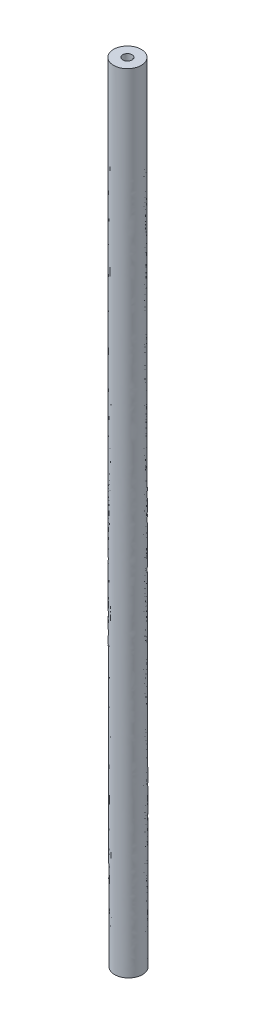
ISO-10303-21;
HEADER;
FILE_DESCRIPTION(('STEP AP214'),'2;1');
FILE_NAME('part.step','',(''),(''),'','','');
FILE_SCHEMA(('AUTOMOTIVE_DESIGN { 1 0 10303 214 1 1 1 1 }'));
ENDSEC;
DATA;
#1=APPLICATION_CONTEXT('core data for automotive mechanical design processes');
#2=APPLICATION_PROTOCOL_DEFINITION('international standard','automotive_design',2000,#1);
#3=PRODUCT_CONTEXT('',#1,'mechanical');
#4=PRODUCT('Part','Part','',(#3));
#5=PRODUCT_RELATED_PRODUCT_CATEGORY('part','',(#4));
#6=PRODUCT_DEFINITION_FORMATION('','',#4);
#7=PRODUCT_DEFINITION_CONTEXT('part definition',#1,'design');
#8=PRODUCT_DEFINITION('design','',#6,#7);
#9=PRODUCT_DEFINITION_SHAPE('','',#8);
#10=(LENGTH_UNIT() NAMED_UNIT(*) SI_UNIT(.MILLI.,.METRE.));
#11=(NAMED_UNIT(*) PLANE_ANGLE_UNIT() SI_UNIT($,.RADIAN.));
#12=(NAMED_UNIT(*) SI_UNIT($,.STERADIAN.) SOLID_ANGLE_UNIT());
#13=UNCERTAINTY_MEASURE_WITH_UNIT(LENGTH_MEASURE(1.E-05),#10,'distance_accuracy_value','');
#14=(GEOMETRIC_REPRESENTATION_CONTEXT(3) GLOBAL_UNCERTAINTY_ASSIGNED_CONTEXT((#13)) GLOBAL_UNIT_ASSIGNED_CONTEXT((#10,
#11,#12)) REPRESENTATION_CONTEXT('',''));
#15=CARTESIAN_POINT('',(0.,0.,0.));
#16=DIRECTION('',(0.,0.,1.));
#17=DIRECTION('',(1.,0.,0.));
#18=AXIS2_PLACEMENT_3D('',#15,#16,#17);
#19=CARTESIAN_POINT('',(0.124999951172267,-85.,1.5));
#20=CARTESIAN_POINT('',(0.104166609701249,-76.666666666647,1.5));
#21=CARTESIAN_POINT('',(0.0833331703333813,-68.3333333049463,1.5));
#22=CARTESIAN_POINT('',(0.0208335264151385,-43.3333681122283,1.5));
#23=CARTESIAN_POINT('',(2.0724184714006E-07,-26.6666840078161,1.5));
#24=CARTESIAN_POINT('',(-4.14483262527916E-08,-6.66666667064939,1.5));
#25=CARTESIAN_POINT('',(0.,-3.33333333333468,1.5));
#26=CARTESIAN_POINT('',(0.,0.,1.5));
#27=CARTESIAN_POINT('',(3.12499057620889,-84.9925000205078,1.5));
#28=CARTESIAN_POINT('',(3.10415723473787,-76.6591666871548,1.5));
#29=CARTESIAN_POINT('',(3.08332223289065,-68.3252083272368,1.5));
#30=CARTESIAN_POINT('',(3.02082727640395,-43.3271181265666,1.5));
#31=CARTESIAN_POINT('',(3.00000020721294,-26.6654340099378,1.5));
#32=CARTESIAN_POINT('',(2.99999995855746,-6.66691666996462,1.5));
#33=CARTESIAN_POINT('',(3.,-3.33333333333468,1.5));
#34=CARTESIAN_POINT('',(3.,0.,1.5));
#35=CARTESIAN_POINT('',(3.12499057620889,-84.9925000205078,-1.5));
#36=CARTESIAN_POINT('',(3.10415723473787,-76.6591666871548,-1.5));
#37=CARTESIAN_POINT('',(3.08332223289065,-68.3252083272368,-1.5));
#38=CARTESIAN_POINT('',(3.02082727640395,-43.3271181265666,-1.5));
#39=CARTESIAN_POINT('',(3.00000020721294,-26.6654340099378,-1.5));
#40=CARTESIAN_POINT('',(2.99999995855746,-6.66691666996462,-1.5));
#41=CARTESIAN_POINT('',(3.,-3.33333333333468,-1.5));
#42=CARTESIAN_POINT('',(3.,0.,-1.5));
#43=CARTESIAN_POINT('',(0.124999951172267,-85.,-1.5));
#44=CARTESIAN_POINT('',(0.104166609701249,-76.666666666647,-1.5));
#45=CARTESIAN_POINT('',(0.0833331703333815,-68.3333333049463,-1.5));
#46=CARTESIAN_POINT('',(0.0208335264151387,-43.3333681122283,-1.5));
#47=CARTESIAN_POINT('',(2.07241847323757E-07,-26.6666840078161,-1.5));
#48=CARTESIAN_POINT('',(-4.14483260690946E-08,-6.66666667064939,-1.5));
#49=CARTESIAN_POINT('',(0.,-3.33333333333468,-1.5));
#50=CARTESIAN_POINT('',(0.,0.,-1.5));
#51=CARTESIAN_POINT('',(-2.87499067386435,-85.0074999794922,-1.5));
#52=CARTESIAN_POINT('',(-2.89582401533537,-76.6741666461392,-1.5));
#53=CARTESIAN_POINT('',(-2.91665589222389,-68.3414582826559,-1.5));
#54=CARTESIAN_POINT('',(-2.97916022357368,-43.3396180978899,-1.5));
#55=CARTESIAN_POINT('',(-2.99999979272924,-26.6679340056943,-1.5));
#56=CARTESIAN_POINT('',(-3.00000004145411,-6.66641667133416,-1.5));
#57=CARTESIAN_POINT('',(-3.,-3.33333333333468,-1.5));
#58=CARTESIAN_POINT('',(-3.,0.,-1.5));
#59=CARTESIAN_POINT('',(-2.87499067386435,-85.0074999794922,1.5));
#60=CARTESIAN_POINT('',(-2.89582401533537,-76.6741666461392,1.5));
#61=CARTESIAN_POINT('',(-2.91665589222389,-68.3414582826559,1.5));
#62=CARTESIAN_POINT('',(-2.97916022357368,-43.3396180978899,1.5));
#63=CARTESIAN_POINT('',(-2.99999979272924,-26.6679340056943,1.5));
#64=CARTESIAN_POINT('',(-3.00000004145411,-6.66641667133416,1.5));
#65=CARTESIAN_POINT('',(-3.,-3.33333333333468,1.5));
#66=CARTESIAN_POINT('',(-3.,0.,1.5));
#67=CARTESIAN_POINT('',(0.124999951172267,-85.,1.5));
#68=CARTESIAN_POINT('',(0.104166609701249,-76.666666666647,1.5));
#69=CARTESIAN_POINT('',(0.0833331703333813,-68.3333333049463,1.5));
#70=CARTESIAN_POINT('',(0.0208335264151385,-43.3333681122283,1.5));
#71=CARTESIAN_POINT('',(2.0724184714006E-07,-26.6666840078161,1.5));
#72=CARTESIAN_POINT('',(-4.14483262527916E-08,-6.66666667064939,1.5));
#73=CARTESIAN_POINT('',(0.,-3.33333333333468,1.5));
#74=CARTESIAN_POINT('',(0.,0.,1.5));
#75=(BOUNDED_SURFACE() B_SPLINE_SURFACE(3,3,((#19,#20,#21,#22,#23,#24,#25,#26),(#27,#28,#29,#30,
#31,#32,#33,#34),(#35,#36,#37,#38,#39,#40,#41,#42),(#43,#44,#45,#46,#47,#48,#49,#50),(#51,#52,
#53,#54,#55,#56,#57,#58),(#59,#60,#61,#62,#63,#64,#65,#66),(#67,#68,#69,#70,#71,#72,#73,#74)),
.UNSPECIFIED.,.T.,.F.,.F.) B_SPLINE_SURFACE_WITH_KNOTS((4,3,4),(4,2,2,4),(0.,0.5,1.),(0.,
0.294118115627878,0.882353121395057,1.),
.UNSPECIFIED.) GEOMETRIC_REPRESENTATION_ITEM() RATIONAL_B_SPLINE_SURFACE(((1.,1.,1.,1.,1.,1.,1.,
1.),(0.333333333333333,0.333333333333333,0.333333333333333,0.333333333333333,0.333333333333333,
0.333333333333333,0.333333333333333,0.333333333333333),(0.333333333333333,0.333333333333333,
0.333333333333333,0.333333333333333,0.333333333333333,0.333333333333333,0.333333333333333,
0.333333333333333),(1.,1.,1.,1.,1.,1.,1.,1.),(0.333333333333333,0.333333333333333,
0.333333333333333,0.333333333333333,0.333333333333333,0.333333333333333,0.333333333333333,
0.333333333333333),(0.333333333333333,0.333333333333333,0.333333333333333,0.333333333333333,
0.333333333333333,0.333333333333333,0.333333333333333,0.333333333333333),(1.,1.,1.,1.,1.,1.,1.,1.))) REPRESENTATION_ITEM('') SURFACE());
#76=CARTESIAN_POINT('',(0.,0.,0.));
#77=DIRECTION('',(0.,1.,0.));
#78=DIRECTION('',(0.,0.,1.));
#79=AXIS2_PLACEMENT_3D('',#76,#77,#78);
#80=CIRCLE('',#79,1.5);
#81=CARTESIAN_POINT('',(0.,0.,1.5));
#82=VERTEX_POINT('',#81);
#83=EDGE_CURVE('E59',#82,#82,#80,.T.);
#84=CARTESIAN_POINT('',(0.124999951172267,-85.,0.));
#85=DIRECTION('',(-0.00249999316405852,0.999996875012207,0.));
#86=DIRECTION('',(0.,0.,1.));
#87=AXIS2_PLACEMENT_3D('',#84,#85,#86);
#88=CIRCLE('',#87,1.5);
#89=CARTESIAN_POINT('',(0.124999951172267,-85.,1.5));
#90=VERTEX_POINT('',#89);
#91=EDGE_CURVE('E48',#90,#90,#88,.T.);
#92=CARTESIAN_POINT('',(0.,0.,1.5));
#93=CARTESIAN_POINT('',(1.777831612656E-06,-0.885418023176545,1.5));
#94=CARTESIAN_POINT('',(8.85991342765471E-07,-1.77083604640011,1.5));
#95=CARTESIAN_POINT('',(-8.98877253564571E-07,-3.54167209296118,1.5));
#96=CARTESIAN_POINT('',(-1.79190558000423E-06,-4.42709011629868,1.5));
#97=CARTESIAN_POINT('',(1.75900542073227E-06,-6.19792616254585,1.5));
#98=CARTESIAN_POINT('',(6.20294474589656E-06,-7.08334418545553,1.5));
#99=CARTESIAN_POINT('',(-6.23502225809553E-06,-8.85418023088871,1.5));
#100=CARTESIAN_POINT('',(-2.31169285688901E-05,-9.73959825341221,1.5));
#101=CARTESIAN_POINT('',(4.26644909528556E-05,-11.5104342964598,1.5));
#102=CARTESIAN_POINT('',(0.000125327816723265,-12.3958523169839,1.5));
#103=CARTESIAN_POINT('',(0.00041308367913828,-14.1666883386019,1.5));
#104=CARTESIAN_POINT('',(0.000618176215846645,-15.0521063396957,1.5));
#105=CARTESIAN_POINT('',(0.00114465874478629,-16.8229423075236,1.5));
#106=CARTESIAN_POINT('',(0.00146604873706903,-17.7083602742577,1.5));
#107=CARTESIAN_POINT('',(0.00222676916431861,-19.4791961574761,1.5));
#108=CARTESIAN_POINT('',(0.0026660995993284,-20.3646140739605,1.5));
#109=CARTESIAN_POINT('',(0.0036622606634537,-22.1354498410469,1.5));
#110=CARTESIAN_POINT('',(0.00421909129260282,-23.020867691649,1.5));
#111=CARTESIAN_POINT('',(0.00545037069686834,-24.7917033112693,1.5));
#112=CARTESIAN_POINT('',(0.00612481947200918,-25.6771210802876,1.5));
#113=CARTESIAN_POINT('',(0.00759130355410078,-27.4479565210572,1.5));
#114=CARTESIAN_POINT('',(0.00838333886106675,-28.3333741928086,1.5));
#115=CARTESIAN_POINT('',(0.0100850044562869,-30.1042094233564,1.5));
#116=CARTESIAN_POINT('',(0.0109946347445471,-30.9896269821528,1.5));
#117=CARTESIAN_POINT('',(0.0129314880633102,-32.7604619711041,1.5));
#118=CARTESIAN_POINT('',(0.01395871109381,-33.6458794012589,1.5));
#119=CARTESIAN_POINT('',(0.016130750348466,-35.4167141172401,1.5));
#120=CARTESIAN_POINT('',(0.0172755665726097,-36.3021314030665,1.5));
#121=CARTESIAN_POINT('',(0.0196827925926552,-38.0729658147027,1.5));
#122=CARTESIAN_POINT('',(0.0209452023885352,-38.9583829405124,1.5));
#123=CARTESIAN_POINT('',(0.0235876135329439,-40.7292170164335,1.5));
#124=CARTESIAN_POINT('',(0.0249676148814416,-41.6146339665449,1.5));
#125=CARTESIAN_POINT('',(0.0278452167741321,-43.3854676753624,1.5));
#126=CARTESIAN_POINT('',(0.0293428173182849,-44.2708844340685,1.5));
#127=CARTESIAN_POINT('',(0.032455588993919,-46.0417177444628,1.5));
#128=CARTESIAN_POINT('',(0.0340707601253511,-46.927134296151,1.5));
#129=CARTESIAN_POINT('',(0.0374187797106737,-48.6979671765454,1.5));
#130=CARTESIAN_POINT('',(0.0391516281645057,-49.5833835052516,1.5));
#131=CARTESIAN_POINT('',(0.0427346040071858,-51.354215925029,1.5));
#132=CARTESIAN_POINT('',(0.0445847313959666,-52.2396320161002,1.5));
#133=CARTESIAN_POINT('',(0.0484037518678921,-54.010463941062,1.5));
#134=CARTESIAN_POINT('',(0.0503726449509594,-54.8958797749528,1.5));
#135=CARTESIAN_POINT('',(0.054423648106224,-56.6667111842665,1.5));
#136=CARTESIAN_POINT('',(0.0565057581783387,-57.5521267596895,1.5));
#137=CARTESIAN_POINT('',(0.0608039033192534,-59.3229575831675,1.5));
#138=CARTESIAN_POINT('',(0.0630199383880248,-60.2083728312225,1.5));
#139=CARTESIAN_POINT('',(0.0674488341988951,-61.9792033347433,1.5));
#140=CARTESIAN_POINT('',(0.0696616949409899,-62.8646185902091,1.5));
#141=CARTESIAN_POINT('',(0.0740882715161526,-64.6354491004521,1.5));
#142=CARTESIAN_POINT('',(0.0763019873492213,-65.5208643552293,1.5));
#143=CARTESIAN_POINT('',(0.0807291935338865,-67.2916948660234,1.5));
#144=CARTESIAN_POINT('',(0.0829426838854827,-68.1771101220402,1.5));
#145=CARTESIAN_POINT('',(0.0873697277522617,-69.947940634538,1.5));
#146=CARTESIAN_POINT('',(0.0895832812674445,-70.833355891019,1.5));
#147=CARTESIAN_POINT('',(0.0940103732263803,-72.6041864043941,1.5));
#148=CARTESIAN_POINT('',(0.0962239116701333,-73.4896016612881,1.5));
#149=CARTESIAN_POINT('',(0.100650993553988,-75.2604321752442,1.5));
#150=CARTESIAN_POINT('',(0.10286453699409,-76.1458474323061,1.5));
#151=CARTESIAN_POINT('',(0.107291622607317,-77.9166779464048,1.5));
#152=CARTESIAN_POINT('',(0.109505164780441,-78.8020932034415,1.5));
#153=CARTESIAN_POINT('',(0.113932248618013,-80.5729237172826,1.5));
#154=CARTESIAN_POINT('',(0.11614579028246,-81.458338974087,1.5));
#155=CARTESIAN_POINT('',(0.120572872105573,-83.2291694872599,1.5));
#156=CARTESIAN_POINT('',(0.122786412264239,-84.1145847436284,1.5));
#157=CARTESIAN_POINT('',(0.124999951172267,-85.,1.5));
#158=B_SPLINE_CURVE_WITH_KNOTS('',3,(#92,#93,#94,#95,#96,#97,#98,#99,#100,#101,#102,#103,#104,
#105,#106,#107,#108,#109,#110,#111,#112,#113,#114,#115,#116,#117,#118,#119,#120,#121,#122,#123,
#124,#125,#126,#127,#128,#129,#130,#131,#132,#133,#134,#135,#136,#137,#138,#139,#140,#141,#142,
#143,#144,#145,#146,#147,#148,#149,#150,#151,#152,#153,#154,#155,#156,#157),.UNSPECIFIED.,.F.,
.F.,(4,2,2,2,2,2,2,2,2,2,2,2,2,2,2,2,2,2,2,2,2,2,2,2,2,2,2,2,2,2,2,2,4),(0.,2.65625406962368,
5.31250813958915,7.9687622085533,10.6250162752304,13.2812703402495,15.937524406652,
18.59377847423,21.2500325427755,23.9062866120806,26.5625406819376,29.2187947521384,
31.8750488224752,34.5313028927402,37.1875569627255,39.8438110322231,42.5000651010253,
45.1563191689243,47.8125732357122,50.4688273011813,53.1250813651237,55.7813354273319,
58.437589487598,61.093843547295,63.7500976104255,66.4063516765612,69.0626057450844,
71.7188598153773,74.3751138868223,77.0313679588016,79.6876220306973,82.3438761018919,
85.0001301717676),.UNSPECIFIED.);
#159=EDGE_CURVE('',#82,#90,#158,.T.);
#160=ORIENTED_EDGE('',*,*,#83,.F.);
#161=ORIENTED_EDGE('',*,*,#91,.T.);
#162=ORIENTED_EDGE('',*,*,#159,.T.);
#163=ORIENTED_EDGE('',*,*,#159,.F.);
#164=EDGE_LOOP('',(#160,#162,#161,#163));
#165=FACE_BOUND('',#164,.T.);
#166=ADVANCED_FACE('F43',(#165),#75,.T.);
#167=CARTESIAN_POINT('',(0.124999951172267,-85.,0.));
#168=DIRECTION('',(-0.00249999316405852,0.999996875012207,0.));
#169=DIRECTION('',(0.,0.,1.));
#170=AXIS2_PLACEMENT_3D('',#167,#168,#169);
#171=PLANE('',#170);
#172=CARTESIAN_POINT('',(0.124999951172267,-85.,0.));
#173=DIRECTION('',(-0.00249999316405852,0.999996875012207,0.));
#174=DIRECTION('',(0.,0.,1.));
#175=AXIS2_PLACEMENT_3D('',#172,#173,#174);
#176=CIRCLE('',#175,0.5);
#177=CARTESIAN_POINT('',(0.124999951172267,-85.,0.5));
#178=VERTEX_POINT('',#177);
#179=EDGE_CURVE('E53',#178,#178,#176,.F.);
#180=ORIENTED_EDGE('',*,*,#179,.F.);
#181=EDGE_LOOP('',(#180));
#182=FACE_BOUND('',#181,.T.);
#183=ORIENTED_EDGE('',*,*,#91,.F.);
#184=EDGE_LOOP('',(#183));
#185=FACE_BOUND('',#184,.T.);
#186=ADVANCED_FACE('F70',(#182,#185),#171,.F.);
#187=CARTESIAN_POINT('',(0.,0.,0.));
#188=DIRECTION('',(0.,1.,0.));
#189=DIRECTION('',(0.,0.,1.));
#190=AXIS2_PLACEMENT_3D('',#187,#188,#189);
#191=PLANE('',#190);
#192=CARTESIAN_POINT('',(0.,0.,0.));
#193=DIRECTION('',(0.,1.,0.));
#194=DIRECTION('',(0.,0.,1.));
#195=AXIS2_PLACEMENT_3D('',#192,#193,#194);
#196=CIRCLE('',#195,0.5);
#197=CARTESIAN_POINT('',(0.,0.,0.5));
#198=VERTEX_POINT('',#197);
#199=EDGE_CURVE('E10',#198,#198,#196,.F.);
#200=ORIENTED_EDGE('',*,*,#199,.T.);
#201=EDGE_LOOP('',(#200));
#202=FACE_BOUND('',#201,.T.);
#203=ORIENTED_EDGE('',*,*,#83,.T.);
#204=EDGE_LOOP('',(#203));
#205=FACE_BOUND('',#204,.T.);
#206=ADVANCED_FACE('F72',(#202,#205),#191,.T.);
#207=CARTESIAN_POINT('',(0.124999951172267,-85.,0.5));
#208=CARTESIAN_POINT('',(0.104166609701249,-76.666666666647,0.5));
#209=CARTESIAN_POINT('',(0.0833331703333813,-68.3333333049463,0.5));
#210=CARTESIAN_POINT('',(0.0208335264151385,-43.3333681122283,0.5));
#211=CARTESIAN_POINT('',(2.0724184714006E-07,-26.6666840078161,0.5));
#212=CARTESIAN_POINT('',(-4.14483262527916E-08,-6.66666667064939,0.5));
#213=CARTESIAN_POINT('',(0.,-3.33333333333468,0.5));
#214=CARTESIAN_POINT('',(0.,0.,0.5));
#215=CARTESIAN_POINT('',(-0.87499692383994,-85.0024999931641,0.5));
#216=CARTESIAN_POINT('',(-0.895830265310958,-76.6691666598111,0.5));
#217=CARTESIAN_POINT('',(-0.916663183852902,-68.3360416308688,0.5));
#218=CARTESIAN_POINT('',(-0.979164390246746,-43.3354514407436,0.5));
#219=CARTESIAN_POINT('',(-0.999999792749118,-26.6671006737803,0.5));
#220=CARTESIAN_POINT('',(-1.00000004145013,-6.66658333754335,0.5));
#221=CARTESIAN_POINT('',(-1.,-3.33333333333468,0.5));
#222=CARTESIAN_POINT('',(-1.,0.,0.5));
#223=CARTESIAN_POINT('',(-0.87499692383994,-85.0024999931641,-0.5));
#224=CARTESIAN_POINT('',(-0.895830265310958,-76.6691666598111,-0.5));
#225=CARTESIAN_POINT('',(-0.916663183852902,-68.3360416308688,-0.5));
#226=CARTESIAN_POINT('',(-0.979164390246746,-43.3354514407436,-0.5));
#227=CARTESIAN_POINT('',(-0.999999792749118,-26.6671006737803,-0.5));
#228=CARTESIAN_POINT('',(-1.00000004145013,-6.66658333754335,-0.5));
#229=CARTESIAN_POINT('',(-1.,-3.33333333333468,-0.5));
#230=CARTESIAN_POINT('',(-1.,0.,-0.5));
#231=CARTESIAN_POINT('',(0.124999951172267,-85.,-0.5));
#232=CARTESIAN_POINT('',(0.104166609701249,-76.666666666647,-0.5));
#233=CARTESIAN_POINT('',(0.0833331703333813,-68.3333333049463,-0.5));
#234=CARTESIAN_POINT('',(0.0208335264151386,-43.3333681122283,-0.5));
#235=CARTESIAN_POINT('',(2.07241847201293E-07,-26.6666840078161,-0.5));
#236=CARTESIAN_POINT('',(-4.14483261915593E-08,-6.66666667064939,-0.5));
#237=CARTESIAN_POINT('',(0.,-3.33333333333468,-0.5));
#238=CARTESIAN_POINT('',(0.,0.,-0.5));
#239=CARTESIAN_POINT('',(1.12499682618447,-84.9975000068359,-0.5));
#240=CARTESIAN_POINT('',(1.10416348471346,-76.664166673483,-0.5));
#241=CARTESIAN_POINT('',(1.08332952451966,-68.3306249790239,-0.5));
#242=CARTESIAN_POINT('',(1.02083144307702,-43.3312847837129,-0.5));
#243=CARTESIAN_POINT('',(1.00000020723281,-26.6662673418518,-0.5));
#244=CARTESIAN_POINT('',(0.999999958553481,-6.66675000375543,-0.5));
#245=CARTESIAN_POINT('',(1.,-3.33333333333468,-0.5));
#246=CARTESIAN_POINT('',(1.,0.,-0.5));
#247=CARTESIAN_POINT('',(1.12499682618447,-84.9975000068359,0.5));
#248=CARTESIAN_POINT('',(1.10416348471346,-76.664166673483,0.5));
#249=CARTESIAN_POINT('',(1.08332952451966,-68.3306249790239,0.5));
#250=CARTESIAN_POINT('',(1.02083144307702,-43.3312847837129,0.5));
#251=CARTESIAN_POINT('',(1.00000020723281,-26.6662673418518,0.5));
#252=CARTESIAN_POINT('',(0.999999958553481,-6.66675000375543,0.5));
#253=CARTESIAN_POINT('',(1.,-3.33333333333468,0.5));
#254=CARTESIAN_POINT('',(1.,0.,0.5));
#255=CARTESIAN_POINT('',(0.124999951172267,-85.,0.5));
#256=CARTESIAN_POINT('',(0.104166609701249,-76.666666666647,0.5));
#257=CARTESIAN_POINT('',(0.0833331703333813,-68.3333333049463,0.5));
#258=CARTESIAN_POINT('',(0.0208335264151385,-43.3333681122283,0.5));
#259=CARTESIAN_POINT('',(2.0724184714006E-07,-26.6666840078161,0.5));
#260=CARTESIAN_POINT('',(-4.14483262527916E-08,-6.66666667064939,0.5));
#261=CARTESIAN_POINT('',(0.,-3.33333333333468,0.5));
#262=CARTESIAN_POINT('',(0.,0.,0.5));
#263=(BOUNDED_SURFACE() B_SPLINE_SURFACE(3,3,((#207,#208,#209,#210,#211,#212,#213,#214),(#215,
#216,#217,#218,#219,#220,#221,#222),(#223,#224,#225,#226,#227,#228,#229,#230),(#231,#232,#233,
#234,#235,#236,#237,#238),(#239,#240,#241,#242,#243,#244,#245,#246),(#247,#248,#249,#250,#251,
#252,#253,#254),(#255,#256,#257,#258,#259,#260,#261,#262)),.UNSPECIFIED.,.T.,.F.,
.F.) B_SPLINE_SURFACE_WITH_KNOTS((4,3,4),(4,2,2,4),(0.,0.5,1.),(0.,0.294118115627878,
0.882353121395057,1.),
.UNSPECIFIED.) GEOMETRIC_REPRESENTATION_ITEM() RATIONAL_B_SPLINE_SURFACE(((1.,1.,1.,1.,1.,1.,1.,
1.),(0.333333333333333,0.333333333333333,0.333333333333333,0.333333333333333,0.333333333333333,
0.333333333333333,0.333333333333333,0.333333333333333),(0.333333333333333,0.333333333333333,
0.333333333333333,0.333333333333333,0.333333333333333,0.333333333333333,0.333333333333333,
0.333333333333333),(1.,1.,1.,1.,1.,1.,1.,1.),(0.333333333333333,0.333333333333333,
0.333333333333333,0.333333333333333,0.333333333333333,0.333333333333333,0.333333333333333,
0.333333333333333),(0.333333333333333,0.333333333333333,0.333333333333333,0.333333333333333,
0.333333333333333,0.333333333333333,0.333333333333333,0.333333333333333),(1.,1.,1.,1.,1.,1.,1.,1.))) REPRESENTATION_ITEM('') SURFACE());
#264=CARTESIAN_POINT('',(0.,0.,0.5));
#265=CARTESIAN_POINT('',(1.777831612656E-06,-0.885418023176545,0.5));
#266=CARTESIAN_POINT('',(8.85991342765471E-07,-1.77083604640011,0.5));
#267=CARTESIAN_POINT('',(-8.98877253564571E-07,-3.54167209296118,0.5));
#268=CARTESIAN_POINT('',(-1.79190558000423E-06,-4.42709011629868,0.5));
#269=CARTESIAN_POINT('',(1.75900542073227E-06,-6.19792616254585,0.5));
#270=CARTESIAN_POINT('',(6.20294474589656E-06,-7.08334418545553,0.5));
#271=CARTESIAN_POINT('',(-6.23502225809553E-06,-8.85418023088871,0.5));
#272=CARTESIAN_POINT('',(-2.31169285688901E-05,-9.73959825341221,0.5));
#273=CARTESIAN_POINT('',(4.26644909528556E-05,-11.5104342964598,0.5));
#274=CARTESIAN_POINT('',(0.000125327816723265,-12.3958523169839,0.5));
#275=CARTESIAN_POINT('',(0.00041308367913828,-14.1666883386019,0.5));
#276=CARTESIAN_POINT('',(0.000618176215846645,-15.0521063396957,0.5));
#277=CARTESIAN_POINT('',(0.00114465874478629,-16.8229423075236,0.5));
#278=CARTESIAN_POINT('',(0.00146604873706903,-17.7083602742577,0.5));
#279=CARTESIAN_POINT('',(0.00222676916431861,-19.4791961574761,0.5));
#280=CARTESIAN_POINT('',(0.0026660995993284,-20.3646140739605,0.5));
#281=CARTESIAN_POINT('',(0.0036622606634537,-22.1354498410469,0.5));
#282=CARTESIAN_POINT('',(0.00421909129260282,-23.020867691649,0.5));
#283=CARTESIAN_POINT('',(0.00545037069686834,-24.7917033112693,0.5));
#284=CARTESIAN_POINT('',(0.00612481947200918,-25.6771210802876,0.5));
#285=CARTESIAN_POINT('',(0.00759130355410078,-27.4479565210572,0.5));
#286=CARTESIAN_POINT('',(0.00838333886106675,-28.3333741928086,0.5));
#287=CARTESIAN_POINT('',(0.0100850044562869,-30.1042094233564,0.5));
#288=CARTESIAN_POINT('',(0.0109946347445471,-30.9896269821528,0.5));
#289=CARTESIAN_POINT('',(0.0129314880633102,-32.7604619711041,0.5));
#290=CARTESIAN_POINT('',(0.01395871109381,-33.6458794012589,0.5));
#291=CARTESIAN_POINT('',(0.016130750348466,-35.4167141172401,0.5));
#292=CARTESIAN_POINT('',(0.0172755665726097,-36.3021314030665,0.5));
#293=CARTESIAN_POINT('',(0.0196827925926552,-38.0729658147027,0.5));
#294=CARTESIAN_POINT('',(0.0209452023885352,-38.9583829405124,0.5));
#295=CARTESIAN_POINT('',(0.0235876135329439,-40.7292170164335,0.5));
#296=CARTESIAN_POINT('',(0.0249676148814416,-41.6146339665449,0.5));
#297=CARTESIAN_POINT('',(0.0278452167741321,-43.3854676753624,0.5));
#298=CARTESIAN_POINT('',(0.0293428173182849,-44.2708844340685,0.5));
#299=CARTESIAN_POINT('',(0.032455588993919,-46.0417177444628,0.5));
#300=CARTESIAN_POINT('',(0.0340707601253511,-46.927134296151,0.5));
#301=CARTESIAN_POINT('',(0.0374187797106737,-48.6979671765454,0.5));
#302=CARTESIAN_POINT('',(0.0391516281645057,-49.5833835052516,0.5));
#303=CARTESIAN_POINT('',(0.0427346040071858,-51.354215925029,0.5));
#304=CARTESIAN_POINT('',(0.0445847313959666,-52.2396320161002,0.5));
#305=CARTESIAN_POINT('',(0.0484037518678921,-54.010463941062,0.5));
#306=CARTESIAN_POINT('',(0.0503726449509594,-54.8958797749528,0.5));
#307=CARTESIAN_POINT('',(0.054423648106224,-56.6667111842665,0.5));
#308=CARTESIAN_POINT('',(0.0565057581783387,-57.5521267596895,0.5));
#309=CARTESIAN_POINT('',(0.0608039033192534,-59.3229575831675,0.5));
#310=CARTESIAN_POINT('',(0.0630199383880248,-60.2083728312225,0.5));
#311=CARTESIAN_POINT('',(0.0674488341988951,-61.9792033347433,0.5));
#312=CARTESIAN_POINT('',(0.0696616949409899,-62.8646185902091,0.5));
#313=CARTESIAN_POINT('',(0.0740882715161526,-64.6354491004521,0.5));
#314=CARTESIAN_POINT('',(0.0763019873492213,-65.5208643552293,0.5));
#315=CARTESIAN_POINT('',(0.0807291935338865,-67.2916948660234,0.5));
#316=CARTESIAN_POINT('',(0.0829426838854827,-68.1771101220402,0.5));
#317=CARTESIAN_POINT('',(0.0873697277522617,-69.947940634538,0.5));
#318=CARTESIAN_POINT('',(0.0895832812674445,-70.833355891019,0.5));
#319=CARTESIAN_POINT('',(0.0940103732263803,-72.6041864043941,0.5));
#320=CARTESIAN_POINT('',(0.0962239116701333,-73.4896016612881,0.5));
#321=CARTESIAN_POINT('',(0.100650993553988,-75.2604321752442,0.5));
#322=CARTESIAN_POINT('',(0.10286453699409,-76.1458474323061,0.5));
#323=CARTESIAN_POINT('',(0.107291622607317,-77.9166779464048,0.5));
#324=CARTESIAN_POINT('',(0.109505164780441,-78.8020932034415,0.5));
#325=CARTESIAN_POINT('',(0.113932248618013,-80.5729237172826,0.5));
#326=CARTESIAN_POINT('',(0.11614579028246,-81.458338974087,0.5));
#327=CARTESIAN_POINT('',(0.120572872105573,-83.2291694872599,0.5));
#328=CARTESIAN_POINT('',(0.122786412264239,-84.1145847436284,0.5));
#329=CARTESIAN_POINT('',(0.124999951172267,-85.,0.5));
#330=B_SPLINE_CURVE_WITH_KNOTS('',3,(#264,#265,#266,#267,#268,#269,#270,#271,#272,#273,#274,
#275,#276,#277,#278,#279,#280,#281,#282,#283,#284,#285,#286,#287,#288,#289,#290,#291,#292,#293,
#294,#295,#296,#297,#298,#299,#300,#301,#302,#303,#304,#305,#306,#307,#308,#309,#310,#311,#312,
#313,#314,#315,#316,#317,#318,#319,#320,#321,#322,#323,#324,#325,#326,#327,#328,#329),
.UNSPECIFIED.,.F.,.F.,(4,2,2,2,2,2,2,2,2,2,2,2,2,2,2,2,2,2,2,2,2,2,2,2,2,2,2,2,2,2,2,2,4),(0.,
2.65625406962368,5.31250813958915,7.9687622085533,10.6250162752304,13.2812703402495,
15.937524406652,18.59377847423,21.2500325427755,23.9062866120806,26.5625406819376,
29.2187947521384,31.8750488224752,34.5313028927402,37.1875569627255,39.8438110322231,
42.5000651010253,45.1563191689243,47.8125732357122,50.4688273011813,53.1250813651237,
55.7813354273319,58.437589487598,61.093843547295,63.7500976104255,66.4063516765612,
69.0626057450844,71.7188598153773,74.3751138868223,77.0313679588016,79.6876220306973,
82.3438761018919,85.0001301717676),.UNSPECIFIED.);
#331=EDGE_CURVE('',#198,#178,#330,.T.);
#332=ORIENTED_EDGE('',*,*,#199,.F.);
#333=ORIENTED_EDGE('',*,*,#179,.T.);
#334=ORIENTED_EDGE('',*,*,#331,.T.);
#335=ORIENTED_EDGE('',*,*,#331,.F.);
#336=EDGE_LOOP('',(#332,#334,#333,#335));
#337=FACE_BOUND('',#336,.T.);
#338=ADVANCED_FACE('F78',(#337),#263,.T.);
#339=CLOSED_SHELL('',(#166,#186,#206,#338));
#340=MANIFOLD_SOLID_BREP('B2',#339);
#341=ADVANCED_BREP_SHAPE_REPRESENTATION('',(#18,#340),#14);
#342=SHAPE_DEFINITION_REPRESENTATION(#9,#341);
ENDSEC;
END-ISO-10303-21;
